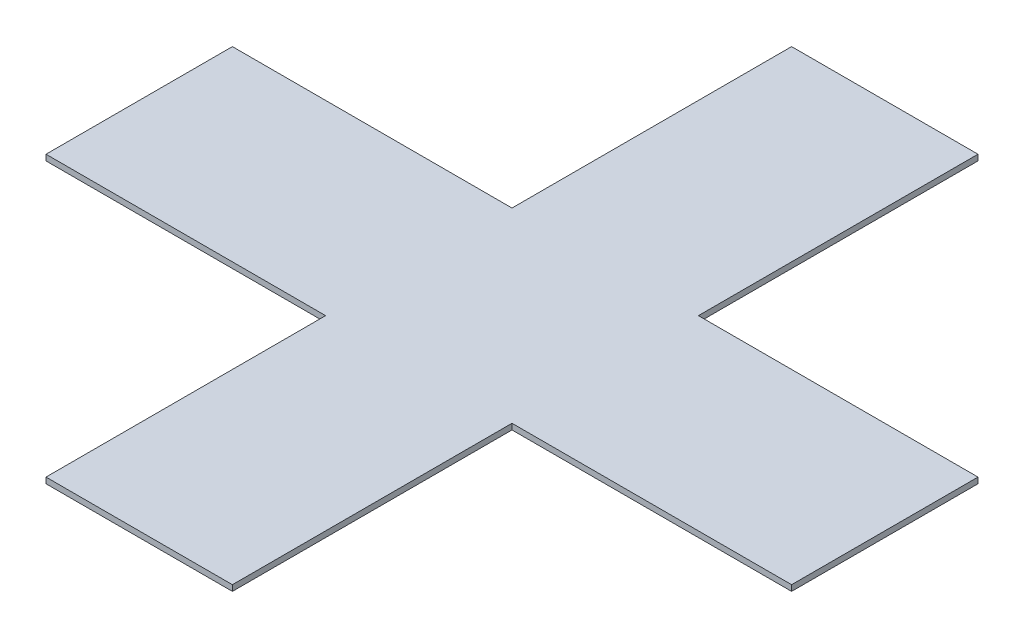
ISO-10303-21;
HEADER;
FILE_DESCRIPTION(('STEP AP214'),'2;1');
FILE_NAME('part.step','',(''),(''),'','','');
FILE_SCHEMA(('AUTOMOTIVE_DESIGN { 1 0 10303 214 1 1 1 1 }'));
ENDSEC;
DATA;
#1=APPLICATION_CONTEXT('core data for automotive mechanical design processes');
#2=APPLICATION_PROTOCOL_DEFINITION('international standard','automotive_design',2000,#1);
#3=PRODUCT_CONTEXT('',#1,'mechanical');
#4=PRODUCT('Part','Part','',(#3));
#5=PRODUCT_RELATED_PRODUCT_CATEGORY('part','',(#4));
#6=PRODUCT_DEFINITION_FORMATION('','',#4);
#7=PRODUCT_DEFINITION_CONTEXT('part definition',#1,'design');
#8=PRODUCT_DEFINITION('design','',#6,#7);
#9=PRODUCT_DEFINITION_SHAPE('','',#8);
#10=(LENGTH_UNIT() NAMED_UNIT(*) SI_UNIT(.MILLI.,.METRE.));
#11=(NAMED_UNIT(*) PLANE_ANGLE_UNIT() SI_UNIT($,.RADIAN.));
#12=(NAMED_UNIT(*) SI_UNIT($,.STERADIAN.) SOLID_ANGLE_UNIT());
#13=UNCERTAINTY_MEASURE_WITH_UNIT(LENGTH_MEASURE(1.E-05),#10,'distance_accuracy_value','');
#14=(GEOMETRIC_REPRESENTATION_CONTEXT(3) GLOBAL_UNCERTAINTY_ASSIGNED_CONTEXT((#13)) GLOBAL_UNIT_ASSIGNED_CONTEXT((#10,
#11,#12)) REPRESENTATION_CONTEXT('',''));
#15=CARTESIAN_POINT('',(0.,0.,0.));
#16=DIRECTION('',(0.,0.,1.));
#17=DIRECTION('',(1.,0.,0.));
#18=AXIS2_PLACEMENT_3D('',#15,#16,#17);
#19=CARTESIAN_POINT('',(25.4,1.5875,-101.6));
#20=DIRECTION('',(0.,1.,0.));
#21=DIRECTION('',(0.,0.,1.));
#22=AXIS2_PLACEMENT_3D('',#19,#20,#21);
#23=PLANE('',#22);
#24=DIRECTION('',(1.,0.,0.));
#25=VECTOR('',#24,1.);
#26=CARTESIAN_POINT('',(-101.6,1.5875,25.4));
#27=LINE('',#26,#25);
#28=CARTESIAN_POINT('',(-25.4,1.5875,25.4));
#29=VERTEX_POINT('',#28);
#30=CARTESIAN_POINT('',(-101.6,1.5875,25.4));
#31=VERTEX_POINT('',#30);
#32=EDGE_CURVE('E154',#29,#31,#27,.F.);
#33=ORIENTED_EDGE('',*,*,#32,.F.);
#34=DIRECTION('',(0.,0.,1.));
#35=VECTOR('',#34,1.);
#36=CARTESIAN_POINT('',(-25.4,1.5875,-101.6));
#37=LINE('',#36,#35);
#38=CARTESIAN_POINT('',(-25.4,1.5875,101.6));
#39=VERTEX_POINT('',#38);
#40=EDGE_CURVE('E151',#39,#29,#37,.F.);
#41=ORIENTED_EDGE('',*,*,#40,.F.);
#42=DIRECTION('',(1.,0.,0.));
#43=VECTOR('',#42,1.);
#44=CARTESIAN_POINT('',(0.,1.5875,101.6));
#45=LINE('',#44,#43);
#46=CARTESIAN_POINT('',(25.4,1.5875,101.6));
#47=VERTEX_POINT('',#46);
#48=EDGE_CURVE('E146',#47,#39,#45,.F.);
#49=ORIENTED_EDGE('',*,*,#48,.F.);
#50=DIRECTION('',(0.,0.,-1.));
#51=VECTOR('',#50,1.);
#52=CARTESIAN_POINT('',(25.4,1.5875,-101.6));
#53=LINE('',#52,#51);
#54=CARTESIAN_POINT('',(25.4,1.5875,25.4));
#55=VERTEX_POINT('',#54);
#56=EDGE_CURVE('E138',#55,#47,#53,.F.);
#57=ORIENTED_EDGE('',*,*,#56,.F.);
#58=DIRECTION('',(1.,0.,0.));
#59=VECTOR('',#58,1.);
#60=CARTESIAN_POINT('',(-101.6,1.5875,25.4));
#61=LINE('',#60,#59);
#62=CARTESIAN_POINT('',(101.6,1.5875,25.4));
#63=VERTEX_POINT('',#62);
#64=EDGE_CURVE('E135',#63,#55,#61,.F.);
#65=ORIENTED_EDGE('',*,*,#64,.F.);
#66=DIRECTION('',(0.,0.,-1.));
#67=VECTOR('',#66,1.);
#68=CARTESIAN_POINT('',(101.6,1.5875,0.));
#69=LINE('',#68,#67);
#70=CARTESIAN_POINT('',(101.6,1.5875,-25.4));
#71=VERTEX_POINT('',#70);
#72=EDGE_CURVE('E127',#71,#63,#69,.F.);
#73=ORIENTED_EDGE('',*,*,#72,.F.);
#74=DIRECTION('',(-1.,0.,0.));
#75=VECTOR('',#74,1.);
#76=CARTESIAN_POINT('',(-101.6,1.5875,-25.4));
#77=LINE('',#76,#75);
#78=CARTESIAN_POINT('',(25.4,1.5875,-25.4));
#79=VERTEX_POINT('',#78);
#80=EDGE_CURVE('E103',#79,#71,#77,.F.);
#81=ORIENTED_EDGE('',*,*,#80,.F.);
#82=DIRECTION('',(0.,0.,-1.));
#83=VECTOR('',#82,1.);
#84=CARTESIAN_POINT('',(25.4,1.5875,-101.6));
#85=LINE('',#84,#83);
#86=CARTESIAN_POINT('',(25.4,1.5875,-101.6));
#87=VERTEX_POINT('',#86);
#88=EDGE_CURVE('E115',#87,#79,#85,.F.);
#89=ORIENTED_EDGE('',*,*,#88,.F.);
#90=DIRECTION('',(1.,0.,0.));
#91=VECTOR('',#90,1.);
#92=CARTESIAN_POINT('',(0.,1.5875,-101.6));
#93=LINE('',#92,#91);
#94=CARTESIAN_POINT('',(-25.4,1.5875,-101.6));
#95=VERTEX_POINT('',#94);
#96=EDGE_CURVE('E19',#87,#95,#93,.F.);
#97=ORIENTED_EDGE('',*,*,#96,.T.);
#98=DIRECTION('',(0.,0.,1.));
#99=VECTOR('',#98,1.);
#100=CARTESIAN_POINT('',(-25.4,1.5875,-101.6));
#101=LINE('',#100,#99);
#102=CARTESIAN_POINT('',(-25.4,1.5875,-25.4));
#103=VERTEX_POINT('',#102);
#104=EDGE_CURVE('E169',#103,#95,#101,.F.);
#105=ORIENTED_EDGE('',*,*,#104,.F.);
#106=DIRECTION('',(-1.,0.,0.));
#107=VECTOR('',#106,1.);
#108=CARTESIAN_POINT('',(-101.6,1.5875,-25.4));
#109=LINE('',#108,#107);
#110=CARTESIAN_POINT('',(-101.6,1.5875,-25.4));
#111=VERTEX_POINT('',#110);
#112=EDGE_CURVE('E167',#111,#103,#109,.F.);
#113=ORIENTED_EDGE('',*,*,#112,.F.);
#114=DIRECTION('',(0.,0.,-1.));
#115=VECTOR('',#114,1.);
#116=CARTESIAN_POINT('',(-101.6,1.5875,0.));
#117=LINE('',#116,#115);
#118=EDGE_CURVE('E160',#111,#31,#117,.F.);
#119=ORIENTED_EDGE('',*,*,#118,.T.);
#120=EDGE_LOOP('',(#33,#41,#49,#57,#65,#73,#81,#89,#97,#105,#113,#119));
#121=FACE_BOUND('',#120,.T.);
#122=ADVANCED_FACE('F16',(#121),#23,.T.);
#123=CARTESIAN_POINT('',(0.,0.,-101.6));
#124=DIRECTION('',(0.,0.,1.));
#125=DIRECTION('',(1.,0.,0.));
#126=AXIS2_PLACEMENT_3D('',#123,#124,#125);
#127=PLANE('',#126);
#128=ORIENTED_EDGE('',*,*,#96,.F.);
#129=DIRECTION('',(0.,1.,0.));
#130=VECTOR('',#129,1.);
#131=CARTESIAN_POINT('',(25.4,0.,-101.6));
#132=LINE('',#131,#130);
#133=CARTESIAN_POINT('',(25.4,0.,-101.6));
#134=VERTEX_POINT('',#133);
#135=EDGE_CURVE('E110',#134,#87,#132,.T.);
#136=ORIENTED_EDGE('',*,*,#135,.F.);
#137=DIRECTION('',(1.,0.,0.));
#138=VECTOR('',#137,1.);
#139=CARTESIAN_POINT('',(-25.4,0.,-101.6));
#140=LINE('',#139,#138);
#141=CARTESIAN_POINT('',(-25.4,0.,-101.6));
#142=VERTEX_POINT('',#141);
#143=EDGE_CURVE('E173',#142,#134,#140,.T.);
#144=ORIENTED_EDGE('',*,*,#143,.F.);
#145=DIRECTION('',(0.,1.,0.));
#146=VECTOR('',#145,1.);
#147=CARTESIAN_POINT('',(-25.4,1.5875,-101.6));
#148=LINE('',#147,#146);
#149=EDGE_CURVE('E113',#95,#142,#148,.F.);
#150=ORIENTED_EDGE('',*,*,#149,.F.);
#151=EDGE_LOOP('',(#128,#136,#144,#150));
#152=FACE_BOUND('',#151,.T.);
#153=ADVANCED_FACE('F108',(#152),#127,.F.);
#154=CARTESIAN_POINT('',(25.4,0.,-101.6));
#155=DIRECTION('',(1.,0.,0.));
#156=DIRECTION('',(0.,0.,-1.));
#157=AXIS2_PLACEMENT_3D('',#154,#155,#156);
#158=PLANE('',#157);
#159=ORIENTED_EDGE('',*,*,#88,.T.);
#160=DIRECTION('',(0.,1.,0.));
#161=VECTOR('',#160,1.);
#162=CARTESIAN_POINT('',(25.4,0.,-25.4));
#163=LINE('',#162,#161);
#164=CARTESIAN_POINT('',(25.4,0.,-25.4));
#165=VERTEX_POINT('',#164);
#166=EDGE_CURVE('E125',#165,#79,#163,.T.);
#167=ORIENTED_EDGE('',*,*,#166,.F.);
#168=DIRECTION('',(0.,0.,-1.));
#169=VECTOR('',#168,1.);
#170=CARTESIAN_POINT('',(25.4,0.,-101.6));
#171=LINE('',#170,#169);
#172=EDGE_CURVE('E121',#134,#165,#171,.F.);
#173=ORIENTED_EDGE('',*,*,#172,.F.);
#174=ORIENTED_EDGE('',*,*,#135,.T.);
#175=EDGE_LOOP('',(#159,#167,#173,#174));
#176=FACE_BOUND('',#175,.T.);
#177=ADVANCED_FACE('F119',(#176),#158,.T.);
#178=CARTESIAN_POINT('',(-101.6,0.,-25.4));
#179=DIRECTION('',(0.,0.,-1.));
#180=DIRECTION('',(-1.,0.,0.));
#181=AXIS2_PLACEMENT_3D('',#178,#179,#180);
#182=PLANE('',#181);
#183=DIRECTION('',(1.,0.,0.));
#184=VECTOR('',#183,1.);
#185=CARTESIAN_POINT('',(-25.4,0.,-25.4));
#186=LINE('',#185,#184);
#187=CARTESIAN_POINT('',(101.6,0.,-25.4));
#188=VERTEX_POINT('',#187);
#189=EDGE_CURVE('E176',#165,#188,#186,.T.);
#190=ORIENTED_EDGE('',*,*,#189,.F.);
#191=ORIENTED_EDGE('',*,*,#166,.T.);
#192=ORIENTED_EDGE('',*,*,#80,.T.);
#193=DIRECTION('',(0.,1.,0.));
#194=VECTOR('',#193,1.);
#195=CARTESIAN_POINT('',(101.6,0.,-25.4));
#196=LINE('',#195,#194);
#197=EDGE_CURVE('E129',#188,#71,#196,.T.);
#198=ORIENTED_EDGE('',*,*,#197,.F.);
#199=EDGE_LOOP('',(#190,#191,#192,#198));
#200=FACE_BOUND('',#199,.T.);
#201=ADVANCED_FACE('F246',(#200),#182,.T.);
#202=CARTESIAN_POINT('',(101.6,0.,0.));
#203=DIRECTION('',(1.,0.,0.));
#204=DIRECTION('',(0.,0.,-1.));
#205=AXIS2_PLACEMENT_3D('',#202,#203,#204);
#206=PLANE('',#205);
#207=DIRECTION('',(0.,0.,-1.));
#208=VECTOR('',#207,1.);
#209=CARTESIAN_POINT('',(101.6,0.,-101.6));
#210=LINE('',#209,#208);
#211=CARTESIAN_POINT('',(101.6,0.,25.4));
#212=VERTEX_POINT('',#211);
#213=EDGE_CURVE('E179',#188,#212,#210,.F.);
#214=ORIENTED_EDGE('',*,*,#213,.F.);
#215=ORIENTED_EDGE('',*,*,#197,.T.);
#216=ORIENTED_EDGE('',*,*,#72,.T.);
#217=DIRECTION('',(0.,1.,0.));
#218=VECTOR('',#217,1.);
#219=CARTESIAN_POINT('',(101.6,1.5875,25.4));
#220=LINE('',#219,#218);
#221=EDGE_CURVE('E132',#212,#63,#220,.T.);
#222=ORIENTED_EDGE('',*,*,#221,.F.);
#223=EDGE_LOOP('',(#214,#215,#216,#222));
#224=FACE_BOUND('',#223,.T.);
#225=ADVANCED_FACE('F242',(#224),#206,.T.);
#226=CARTESIAN_POINT('',(-101.6,1.5875,25.4));
#227=DIRECTION('',(0.,0.,1.));
#228=DIRECTION('',(1.,0.,0.));
#229=AXIS2_PLACEMENT_3D('',#226,#227,#228);
#230=PLANE('',#229);
#231=ORIENTED_EDGE('',*,*,#64,.T.);
#232=DIRECTION('',(0.,1.,0.));
#233=VECTOR('',#232,1.);
#234=CARTESIAN_POINT('',(25.4,0.,25.4));
#235=LINE('',#234,#233);
#236=CARTESIAN_POINT('',(25.4,0.,25.4));
#237=VERTEX_POINT('',#236);
#238=EDGE_CURVE('E140',#237,#55,#235,.T.);
#239=ORIENTED_EDGE('',*,*,#238,.F.);
#240=DIRECTION('',(1.,0.,0.));
#241=VECTOR('',#240,1.);
#242=CARTESIAN_POINT('',(-25.4,0.,25.4));
#243=LINE('',#242,#241);
#244=EDGE_CURVE('E182',#212,#237,#243,.F.);
#245=ORIENTED_EDGE('',*,*,#244,.F.);
#246=ORIENTED_EDGE('',*,*,#221,.T.);
#247=EDGE_LOOP('',(#231,#239,#245,#246));
#248=FACE_BOUND('',#247,.T.);
#249=ADVANCED_FACE('F238',(#248),#230,.T.);
#250=CARTESIAN_POINT('',(25.4,0.,-101.6));
#251=DIRECTION('',(1.,0.,0.));
#252=DIRECTION('',(0.,0.,-1.));
#253=AXIS2_PLACEMENT_3D('',#250,#251,#252);
#254=PLANE('',#253);
#255=DIRECTION('',(0.,0.,-1.));
#256=VECTOR('',#255,1.);
#257=CARTESIAN_POINT('',(25.4,0.,-101.6));
#258=LINE('',#257,#256);
#259=CARTESIAN_POINT('',(25.4,0.,101.6));
#260=VERTEX_POINT('',#259);
#261=EDGE_CURVE('E185',#237,#260,#258,.F.);
#262=ORIENTED_EDGE('',*,*,#261,.F.);
#263=ORIENTED_EDGE('',*,*,#238,.T.);
#264=ORIENTED_EDGE('',*,*,#56,.T.);
#265=DIRECTION('',(0.,1.,0.));
#266=VECTOR('',#265,1.);
#267=CARTESIAN_POINT('',(25.4,0.,101.6));
#268=LINE('',#267,#266);
#269=EDGE_CURVE('E143',#260,#47,#268,.T.);
#270=ORIENTED_EDGE('',*,*,#269,.F.);
#271=EDGE_LOOP('',(#262,#263,#264,#270));
#272=FACE_BOUND('',#271,.T.);
#273=ADVANCED_FACE('F234',(#272),#254,.T.);
#274=CARTESIAN_POINT('',(0.,0.,101.6));
#275=DIRECTION('',(0.,0.,1.));
#276=DIRECTION('',(1.,0.,0.));
#277=AXIS2_PLACEMENT_3D('',#274,#275,#276);
#278=PLANE('',#277);
#279=DIRECTION('',(0.,1.,0.));
#280=VECTOR('',#279,1.);
#281=CARTESIAN_POINT('',(-25.4,1.5875,101.6));
#282=LINE('',#281,#280);
#283=CARTESIAN_POINT('',(-25.4,0.,101.6));
#284=VERTEX_POINT('',#283);
#285=EDGE_CURVE('E148',#284,#39,#282,.T.);
#286=ORIENTED_EDGE('',*,*,#285,.F.);
#287=DIRECTION('',(1.,0.,0.));
#288=VECTOR('',#287,1.);
#289=CARTESIAN_POINT('',(-25.4,0.,101.6));
#290=LINE('',#289,#288);
#291=EDGE_CURVE('E188',#260,#284,#290,.F.);
#292=ORIENTED_EDGE('',*,*,#291,.F.);
#293=ORIENTED_EDGE('',*,*,#269,.T.);
#294=ORIENTED_EDGE('',*,*,#48,.T.);
#295=EDGE_LOOP('',(#286,#292,#293,#294));
#296=FACE_BOUND('',#295,.T.);
#297=ADVANCED_FACE('F230',(#296),#278,.T.);
#298=CARTESIAN_POINT('',(-25.4,1.5875,-101.6));
#299=DIRECTION('',(-1.,0.,0.));
#300=DIRECTION('',(0.,0.,1.));
#301=AXIS2_PLACEMENT_3D('',#298,#299,#300);
#302=PLANE('',#301);
#303=ORIENTED_EDGE('',*,*,#40,.T.);
#304=DIRECTION('',(0.,1.,0.));
#305=VECTOR('',#304,1.);
#306=CARTESIAN_POINT('',(-25.4,1.5875,25.4));
#307=LINE('',#306,#305);
#308=CARTESIAN_POINT('',(-25.4,0.,25.4));
#309=VERTEX_POINT('',#308);
#310=EDGE_CURVE('E157',#309,#29,#307,.T.);
#311=ORIENTED_EDGE('',*,*,#310,.F.);
#312=DIRECTION('',(0.,0.,-1.));
#313=VECTOR('',#312,1.);
#314=CARTESIAN_POINT('',(-25.4,0.,-101.6));
#315=LINE('',#314,#313);
#316=EDGE_CURVE('E191',#284,#309,#315,.T.);
#317=ORIENTED_EDGE('',*,*,#316,.F.);
#318=ORIENTED_EDGE('',*,*,#285,.T.);
#319=EDGE_LOOP('',(#303,#311,#317,#318));
#320=FACE_BOUND('',#319,.T.);
#321=ADVANCED_FACE('F226',(#320),#302,.T.);
#322=CARTESIAN_POINT('',(-101.6,1.5875,25.4));
#323=DIRECTION('',(0.,0.,1.));
#324=DIRECTION('',(1.,0.,0.));
#325=AXIS2_PLACEMENT_3D('',#322,#323,#324);
#326=PLANE('',#325);
#327=DIRECTION('',(1.,0.,0.));
#328=VECTOR('',#327,1.);
#329=CARTESIAN_POINT('',(-25.4,0.,25.4));
#330=LINE('',#329,#328);
#331=CARTESIAN_POINT('',(-101.6,0.,25.4));
#332=VERTEX_POINT('',#331);
#333=EDGE_CURVE('E194',#309,#332,#330,.F.);
#334=ORIENTED_EDGE('',*,*,#333,.F.);
#335=ORIENTED_EDGE('',*,*,#310,.T.);
#336=ORIENTED_EDGE('',*,*,#32,.T.);
#337=DIRECTION('',(0.,1.,0.));
#338=VECTOR('',#337,1.);
#339=CARTESIAN_POINT('',(-101.6,0.,25.4));
#340=LINE('',#339,#338);
#341=EDGE_CURVE('E162',#31,#332,#340,.F.);
#342=ORIENTED_EDGE('',*,*,#341,.T.);
#343=EDGE_LOOP('',(#334,#335,#336,#342));
#344=FACE_BOUND('',#343,.T.);
#345=ADVANCED_FACE('F223',(#344),#326,.T.);
#346=CARTESIAN_POINT('',(-101.6,0.,0.));
#347=DIRECTION('',(1.,0.,0.));
#348=DIRECTION('',(0.,0.,-1.));
#349=AXIS2_PLACEMENT_3D('',#346,#347,#348);
#350=PLANE('',#349);
#351=ORIENTED_EDGE('',*,*,#341,.F.);
#352=ORIENTED_EDGE('',*,*,#118,.F.);
#353=DIRECTION('',(0.,1.,0.));
#354=VECTOR('',#353,1.);
#355=CARTESIAN_POINT('',(-101.6,0.,-25.4));
#356=LINE('',#355,#354);
#357=CARTESIAN_POINT('',(-101.6,0.,-25.4));
#358=VERTEX_POINT('',#357);
#359=EDGE_CURVE('E164',#358,#111,#356,.T.);
#360=ORIENTED_EDGE('',*,*,#359,.F.);
#361=DIRECTION('',(0.,0.,-1.));
#362=VECTOR('',#361,1.);
#363=CARTESIAN_POINT('',(-101.6,0.,-101.6));
#364=LINE('',#363,#362);
#365=EDGE_CURVE('E197',#332,#358,#364,.T.);
#366=ORIENTED_EDGE('',*,*,#365,.F.);
#367=EDGE_LOOP('',(#351,#352,#360,#366));
#368=FACE_BOUND('',#367,.T.);
#369=ADVANCED_FACE('F208',(#368),#350,.F.);
#370=CARTESIAN_POINT('',(-101.6,0.,-25.4));
#371=DIRECTION('',(0.,0.,-1.));
#372=DIRECTION('',(-1.,0.,0.));
#373=AXIS2_PLACEMENT_3D('',#370,#371,#372);
#374=PLANE('',#373);
#375=ORIENTED_EDGE('',*,*,#112,.T.);
#376=DIRECTION('',(0.,1.,0.));
#377=VECTOR('',#376,1.);
#378=CARTESIAN_POINT('',(-25.4,1.5875,-25.4));
#379=LINE('',#378,#377);
#380=CARTESIAN_POINT('',(-25.4,0.,-25.4));
#381=VERTEX_POINT('',#380);
#382=EDGE_CURVE('E34',#381,#103,#379,.T.);
#383=ORIENTED_EDGE('',*,*,#382,.F.);
#384=DIRECTION('',(1.,0.,0.));
#385=VECTOR('',#384,1.);
#386=CARTESIAN_POINT('',(-25.4,0.,-25.4));
#387=LINE('',#386,#385);
#388=EDGE_CURVE('E25',#358,#381,#387,.T.);
#389=ORIENTED_EDGE('',*,*,#388,.F.);
#390=ORIENTED_EDGE('',*,*,#359,.T.);
#391=EDGE_LOOP('',(#375,#383,#389,#390));
#392=FACE_BOUND('',#391,.T.);
#393=ADVANCED_FACE('F204',(#392),#374,.T.);
#394=CARTESIAN_POINT('',(-25.4,1.5875,-101.6));
#395=DIRECTION('',(-1.,0.,0.));
#396=DIRECTION('',(0.,0.,1.));
#397=AXIS2_PLACEMENT_3D('',#394,#395,#396);
#398=PLANE('',#397);
#399=DIRECTION('',(0.,0.,-1.));
#400=VECTOR('',#399,1.);
#401=CARTESIAN_POINT('',(-25.4,0.,-101.6));
#402=LINE('',#401,#400);
#403=EDGE_CURVE('E11',#381,#142,#402,.T.);
#404=ORIENTED_EDGE('',*,*,#403,.F.);
#405=ORIENTED_EDGE('',*,*,#382,.T.);
#406=ORIENTED_EDGE('',*,*,#104,.T.);
#407=ORIENTED_EDGE('',*,*,#149,.T.);
#408=EDGE_LOOP('',(#404,#405,#406,#407));
#409=FACE_BOUND('',#408,.T.);
#410=ADVANCED_FACE('F210',(#409),#398,.T.);
#411=CARTESIAN_POINT('',(-25.4,0.,-101.6));
#412=DIRECTION('',(0.,-1.,0.));
#413=DIRECTION('',(0.,0.,-1.));
#414=AXIS2_PLACEMENT_3D('',#411,#412,#413);
#415=PLANE('',#414);
#416=ORIENTED_EDGE('',*,*,#388,.T.);
#417=ORIENTED_EDGE('',*,*,#403,.T.);
#418=ORIENTED_EDGE('',*,*,#143,.T.);
#419=ORIENTED_EDGE('',*,*,#172,.T.);
#420=ORIENTED_EDGE('',*,*,#189,.T.);
#421=ORIENTED_EDGE('',*,*,#213,.T.);
#422=ORIENTED_EDGE('',*,*,#244,.T.);
#423=ORIENTED_EDGE('',*,*,#261,.T.);
#424=ORIENTED_EDGE('',*,*,#291,.T.);
#425=ORIENTED_EDGE('',*,*,#316,.T.);
#426=ORIENTED_EDGE('',*,*,#333,.T.);
#427=ORIENTED_EDGE('',*,*,#365,.T.);
#428=EDGE_LOOP('',(#416,#417,#418,#419,#420,#421,#422,#423,#424,#425,#426,#427));
#429=FACE_BOUND('',#428,.T.);
#430=ADVANCED_FACE('F202',(#429),#415,.T.);
#431=CLOSED_SHELL('',(#122,#153,#177,#201,#225,#249,#273,#297,#321,#345,#369,#393,#410,#430));
#432=MANIFOLD_SOLID_BREP('B1',#431);
#433=ADVANCED_BREP_SHAPE_REPRESENTATION('',(#18,#432),#14);
#434=SHAPE_DEFINITION_REPRESENTATION(#9,#433);
ENDSEC;
END-ISO-10303-21;
